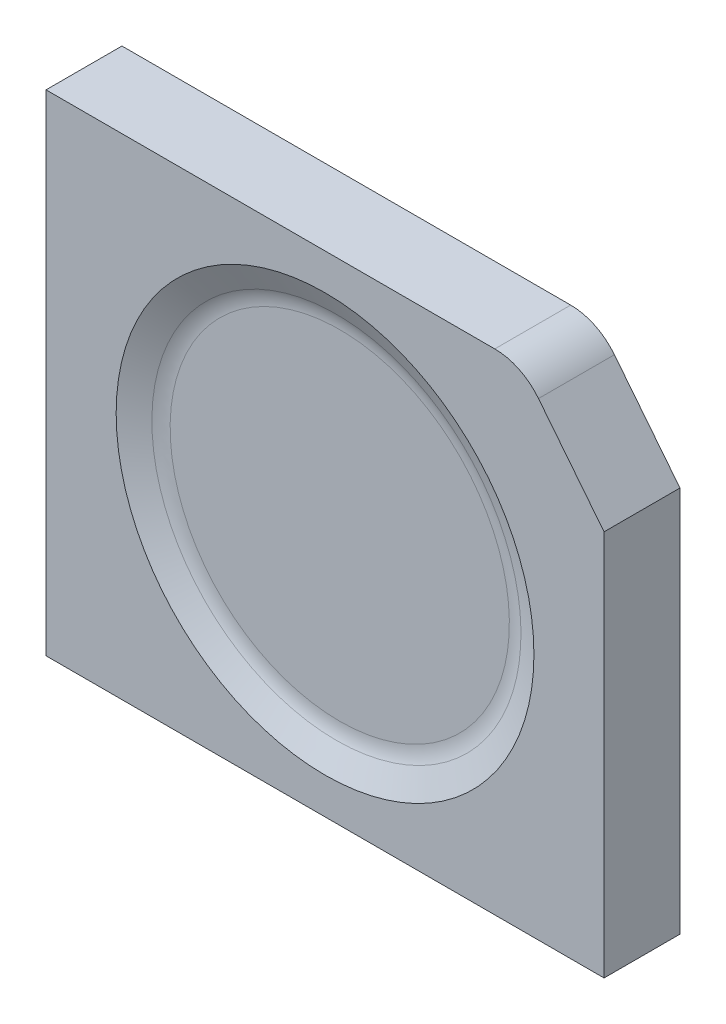
ISO-10303-21;
HEADER;
FILE_DESCRIPTION(('STEP AP214'),'2;1');
FILE_NAME('part.step','',(''),(''),'','','');
FILE_SCHEMA(('AUTOMOTIVE_DESIGN { 1 0 10303 214 1 1 1 1 }'));
ENDSEC;
DATA;
#1=APPLICATION_CONTEXT('core data for automotive mechanical design processes');
#2=APPLICATION_PROTOCOL_DEFINITION('international standard','automotive_design',2000,#1);
#3=PRODUCT_CONTEXT('',#1,'mechanical');
#4=PRODUCT('Part','Part','',(#3));
#5=PRODUCT_RELATED_PRODUCT_CATEGORY('part','',(#4));
#6=PRODUCT_DEFINITION_FORMATION('','',#4);
#7=PRODUCT_DEFINITION_CONTEXT('part definition',#1,'design');
#8=PRODUCT_DEFINITION('design','',#6,#7);
#9=PRODUCT_DEFINITION_SHAPE('','',#8);
#10=(LENGTH_UNIT() NAMED_UNIT(*) SI_UNIT(.MILLI.,.METRE.));
#11=(NAMED_UNIT(*) PLANE_ANGLE_UNIT() SI_UNIT($,.RADIAN.));
#12=(NAMED_UNIT(*) SI_UNIT($,.STERADIAN.) SOLID_ANGLE_UNIT());
#13=UNCERTAINTY_MEASURE_WITH_UNIT(LENGTH_MEASURE(1.E-05),#10,'distance_accuracy_value','');
#14=(GEOMETRIC_REPRESENTATION_CONTEXT(3) GLOBAL_UNCERTAINTY_ASSIGNED_CONTEXT((#13)) GLOBAL_UNIT_ASSIGNED_CONTEXT((#10,
#11,#12)) REPRESENTATION_CONTEXT('',''));
#15=CARTESIAN_POINT('',(0.,0.,0.));
#16=DIRECTION('',(0.,0.,1.));
#17=DIRECTION('',(1.,0.,0.));
#18=AXIS2_PLACEMENT_3D('',#15,#16,#17);
#19=CARTESIAN_POINT('',(0.,0.,150.542283063692));
#20=DIRECTION('',(0.,0.,-1.));
#21=DIRECTION('',(-1.,0.,0.));
#22=AXIS2_PLACEMENT_3D('',#19,#20,#21);
#23=PLANE('',#22);
#24=CARTESIAN_POINT('',(149.999999999993,131.7625,150.542283063692));
#25=DIRECTION('',(0.,0.,-1.));
#26=DIRECTION('',(-1.,0.,0.));
#27=AXIS2_PLACEMENT_3D('',#24,#25,#26);
#28=CIRCLE('',#27,112.298492350913);
#29=CARTESIAN_POINT('',(37.7015076490804,131.7625,150.542283063692));
#30=VERTEX_POINT('',#29);
#31=EDGE_CURVE('E108',#30,#30,#28,.F.);
#32=ORIENTED_EDGE('',*,*,#31,.T.);
#33=EDGE_LOOP('',(#32));
#34=FACE_BOUND('',#33,.T.);
#35=CARTESIAN_POINT('',(241.253264434507,233.525,150.542283063692));
#36=DIRECTION('',(0.,0.,-1.));
#37=DIRECTION('',(-1.,0.,0.));
#38=AXIS2_PLACEMENT_3D('',#35,#36,#37);
#39=CIRCLE('',#38,30.);
#40=CARTESIAN_POINT('',(241.253264434507,263.525,150.542283063692));
#41=VERTEX_POINT('',#40);
#42=CARTESIAN_POINT('',(264.758194807193,252.166841330061,150.542283063692));
#43=VERTEX_POINT('',#42);
#44=EDGE_CURVE('E115',#41,#43,#39,.T.);
#45=ORIENTED_EDGE('',*,*,#44,.T.);
#46=DIRECTION('',(0.621394711002044,-0.783497679089534,0.));
#47=VECTOR('',#46,1.);
#48=CARTESIAN_POINT('',(264.758194807193,252.166841330061,150.542283063692));
#49=LINE('',#48,#47);
#50=CARTESIAN_POINT('',(300.,207.73152173913,150.542283063692));
#51=VERTEX_POINT('',#50);
#52=EDGE_CURVE('E113',#43,#51,#49,.T.);
#53=ORIENTED_EDGE('',*,*,#52,.T.);
#54=DIRECTION('',(0.,-1.,0.));
#55=VECTOR('',#54,1.);
#56=CARTESIAN_POINT('',(300.,0.,150.542283063692));
#57=LINE('',#56,#55);
#58=CARTESIAN_POINT('',(300.,0.,150.542283063692));
#59=VERTEX_POINT('',#58);
#60=EDGE_CURVE('E107',#51,#59,#57,.T.);
#61=ORIENTED_EDGE('',*,*,#60,.T.);
#62=DIRECTION('',(-1.,0.,0.));
#63=VECTOR('',#62,1.);
#64=CARTESIAN_POINT('',(0.,0.,150.542283063692));
#65=LINE('',#64,#63);
#66=CARTESIAN_POINT('',(0.,0.,150.542283063692));
#67=VERTEX_POINT('',#66);
#68=EDGE_CURVE('E92',#59,#67,#65,.T.);
#69=ORIENTED_EDGE('',*,*,#68,.T.);
#70=DIRECTION('',(0.,1.,0.));
#71=VECTOR('',#70,1.);
#72=CARTESIAN_POINT('',(0.,263.525,150.542283063692));
#73=LINE('',#72,#71);
#74=CARTESIAN_POINT('',(0.,263.525,150.542283063692));
#75=VERTEX_POINT('',#74);
#76=EDGE_CURVE('E104',#67,#75,#73,.T.);
#77=ORIENTED_EDGE('',*,*,#76,.T.);
#78=DIRECTION('',(-1.,0.,0.));
#79=VECTOR('',#78,1.);
#80=CARTESIAN_POINT('',(0.,263.525,150.542283063692));
#81=LINE('',#80,#79);
#82=EDGE_CURVE('E137',#41,#75,#81,.T.);
#83=ORIENTED_EDGE('',*,*,#82,.F.);
#84=EDGE_LOOP('',(#45,#53,#61,#69,#77,#83));
#85=FACE_BOUND('',#84,.T.);
#86=ADVANCED_FACE('F34',(#34,#85),#23,.T.);
#87=CARTESIAN_POINT('',(149.999999999992,131.762500000001,183.447474194888));
#88=DIRECTION('',(0.,0.,-1.));
#89=DIRECTION('',(0.,1.,0.));
#90=AXIS2_PLACEMENT_3D('',#87,#88,#89);
#91=PLANE('',#90);
#92=CARTESIAN_POINT('',(149.999999999992,131.7625,183.447474194888));
#93=DIRECTION('',(0.,0.,1.));
#94=DIRECTION('',(0.,-1.,0.));
#95=AXIS2_PLACEMENT_3D('',#92,#93,#94);
#96=CIRCLE('',#95,91.1860000000005);
#97=CARTESIAN_POINT('',(149.999999999992,40.5764999999999,183.447474194888));
#98=VERTEX_POINT('',#97);
#99=EDGE_CURVE('E122',#98,#98,#96,.T.);
#100=ORIENTED_EDGE('',*,*,#99,.T.);
#101=EDGE_LOOP('',(#100));
#102=FACE_BOUND('',#101,.T.);
#103=ADVANCED_FACE('F158',(#102),#91,.F.);
#104=CARTESIAN_POINT('',(149.999999999992,40.5765,183.447474194888));
#105=CARTESIAN_POINT('',(149.999999999992,37.7694243510798,183.447474194887));
#106=CARTESIAN_POINT('',(149.999999999992,35.0528419151209,184.061599328128));
#107=CARTESIAN_POINT('',(149.999999999992,32.5497747474938,185.23231085184));
#108=(BOUNDED_CURVE() B_SPLINE_CURVE(3,(#104,#105,#106,#107),.UNSPECIFIED.,.F.,
.F.) B_SPLINE_CURVE_WITH_KNOTS((4,4),(0.,1.),
.UNSPECIFIED.) CURVE() GEOMETRIC_REPRESENTATION_ITEM() RATIONAL_B_SPLINE_CURVE((0.254333095030252,
0.254333095030252,0.258499793724843,0.266833191114025)) REPRESENTATION_ITEM(''));
#109=CARTESIAN_POINT('',(149.999999999992,131.7625,225.400182821008));
#110=DIRECTION('',(0.,0.,1.));
#111=AXIS1_PLACEMENT('',#109,#110);
#112=SURFACE_OF_REVOLUTION('',#108,#111);
#113=CARTESIAN_POINT('',(149.999999999992,131.7625,185.23231085184));
#114=DIRECTION('',(0.,0.,1.));
#115=DIRECTION('',(0.,-1.,0.));
#116=AXIS2_PLACEMENT_3D('',#113,#114,#115);
#117=CIRCLE('',#116,99.2127252525066);
#118=CARTESIAN_POINT('',(149.999999999992,32.5497747474938,185.23231085184));
#119=VERTEX_POINT('',#118);
#120=EDGE_CURVE('E147',#119,#119,#117,.T.);
#121=ORIENTED_EDGE('',*,*,#120,.T.);
#122=EDGE_LOOP('',(#121));
#123=FACE_BOUND('',#122,.T.);
#124=ORIENTED_EDGE('',*,*,#99,.F.);
#125=EDGE_LOOP('',(#124));
#126=FACE_BOUND('',#125,.T.);
#127=ADVANCED_FACE('F153',(#123,#126),#112,.F.);
#128=CARTESIAN_POINT('',(149.999999999992,131.7625,185.23231085184));
#129=DIRECTION('',(0.,0.,1.));
#130=DIRECTION('',(0.,-1.,0.));
#131=AXIS2_PLACEMENT_3D('',#128,#129,#130);
#132=CONICAL_SURFACE('',#131,99.2127252525066,1.13331210913786);
#133=CARTESIAN_POINT('',(149.999999999992,131.7625,191.352665326085));
#134=DIRECTION('',(0.,0.,1.));
#135=DIRECTION('',(0.,-1.,0.));
#136=AXIS2_PLACEMENT_3D('',#133,#134,#135);
#137=CIRCLE('',#136,112.298492350919);
#138=CARTESIAN_POINT('',(149.999999999992,19.4640076490818,191.352665326084));
#139=VERTEX_POINT('',#138);
#140=EDGE_CURVE('E206',#139,#139,#137,.T.);
#141=ORIENTED_EDGE('',*,*,#140,.T.);
#142=EDGE_LOOP('',(#141));
#143=FACE_BOUND('',#142,.T.);
#144=ORIENTED_EDGE('',*,*,#120,.F.);
#145=EDGE_LOOP('',(#144));
#146=FACE_BOUND('',#145,.T.);
#147=ADVANCED_FACE('F157',(#143,#146),#132,.F.);
#148=CARTESIAN_POINT('',(300.,0.,286.76549888));
#149=DIRECTION('',(-1.,0.,0.));
#150=DIRECTION('',(0.,-1.,0.));
#151=AXIS2_PLACEMENT_3D('',#148,#149,#150);
#152=PLANE('',#151);
#153=ORIENTED_EDGE('',*,*,#60,.F.);
#154=DIRECTION('',(0.,0.,-1.));
#155=VECTOR('',#154,1.);
#156=CARTESIAN_POINT('',(300.,207.73152173913,286.76549888));
#157=LINE('',#156,#155);
#158=CARTESIAN_POINT('',(300.,207.73152173913,191.352665326085));
#159=VERTEX_POINT('',#158);
#160=EDGE_CURVE('E121',#159,#51,#157,.T.);
#161=ORIENTED_EDGE('',*,*,#160,.F.);
#162=DIRECTION('',(0.,-1.,0.));
#163=VECTOR('',#162,1.);
#164=CARTESIAN_POINT('',(300.,3.30149878716484E-13,191.352665326084));
#165=LINE('',#164,#163);
#166=CARTESIAN_POINT('',(300.,0.,191.352665326084));
#167=VERTEX_POINT('',#166);
#168=EDGE_CURVE('E127',#159,#167,#165,.T.);
#169=ORIENTED_EDGE('',*,*,#168,.T.);
#170=DIRECTION('',(0.,0.,-1.));
#171=VECTOR('',#170,1.);
#172=CARTESIAN_POINT('',(300.,0.,286.76549888));
#173=LINE('',#172,#171);
#174=EDGE_CURVE('E98',#167,#59,#173,.T.);
#175=ORIENTED_EDGE('',*,*,#174,.T.);
#176=EDGE_LOOP('',(#153,#161,#169,#175));
#177=FACE_BOUND('',#176,.T.);
#178=ADVANCED_FACE('F125',(#177),#152,.F.);
#179=CARTESIAN_POINT('',(0.,263.525,0.));
#180=DIRECTION('',(0.,1.,0.));
#181=DIRECTION('',(0.,0.,1.));
#182=AXIS2_PLACEMENT_3D('',#179,#180,#181);
#183=PLANE('',#182);
#184=DIRECTION('',(0.,0.,-1.));
#185=VECTOR('',#184,1.);
#186=CARTESIAN_POINT('',(241.253264434507,263.525,286.76549888));
#187=LINE('',#186,#185);
#188=CARTESIAN_POINT('',(241.253264434507,263.525,191.352665326085));
#189=VERTEX_POINT('',#188);
#190=EDGE_CURVE('E11',#189,#41,#187,.T.);
#191=ORIENTED_EDGE('',*,*,#190,.T.);
#192=ORIENTED_EDGE('',*,*,#82,.T.);
#193=DIRECTION('',(0.,0.,-1.));
#194=VECTOR('',#193,1.);
#195=CARTESIAN_POINT('',(0.,263.525,286.76549888));
#196=LINE('',#195,#194);
#197=CARTESIAN_POINT('',(0.,263.525,191.352665326085));
#198=VERTEX_POINT('',#197);
#199=EDGE_CURVE('E42',#198,#75,#196,.T.);
#200=ORIENTED_EDGE('',*,*,#199,.F.);
#201=DIRECTION('',(-1.,0.,0.));
#202=VECTOR('',#201,1.);
#203=CARTESIAN_POINT('',(0.,263.525,191.352665326085));
#204=LINE('',#203,#202);
#205=EDGE_CURVE('E134',#189,#198,#204,.T.);
#206=ORIENTED_EDGE('',*,*,#205,.F.);
#207=EDGE_LOOP('',(#191,#192,#200,#206));
#208=FACE_BOUND('',#207,.T.);
#209=ADVANCED_FACE('F217',(#208),#183,.T.);
#210=CARTESIAN_POINT('',(0.,-6.62123289879906E-13,191.352665326084));
#211=DIRECTION('',(0.,0.,-1.));
#212=DIRECTION('',(0.,1.,0.));
#213=AXIS2_PLACEMENT_3D('',#210,#211,#212);
#214=PLANE('',#213);
#215=DIRECTION('',(-1.,0.,0.));
#216=VECTOR('',#215,1.);
#217=CARTESIAN_POINT('',(0.,0.,191.352665326084));
#218=LINE('',#217,#216);
#219=CARTESIAN_POINT('',(0.,0.,191.352665326085));
#220=VERTEX_POINT('',#219);
#221=EDGE_CURVE('E95',#167,#220,#218,.T.);
#222=ORIENTED_EDGE('',*,*,#221,.F.);
#223=ORIENTED_EDGE('',*,*,#168,.F.);
#224=DIRECTION('',(0.621394711002044,-0.783497679089534,0.));
#225=VECTOR('',#224,1.);
#226=CARTESIAN_POINT('',(264.758194807193,252.166841330062,191.352665326085));
#227=LINE('',#226,#225);
#228=CARTESIAN_POINT('',(264.758194807193,252.166841330061,191.352665326085));
#229=VERTEX_POINT('',#228);
#230=EDGE_CURVE('E56',#229,#159,#227,.T.);
#231=ORIENTED_EDGE('',*,*,#230,.F.);
#232=CARTESIAN_POINT('',(241.253264434507,233.525,191.352665326085));
#233=DIRECTION('',(0.,0.,-1.));
#234=DIRECTION('',(0.,1.,0.));
#235=AXIS2_PLACEMENT_3D('',#232,#233,#234);
#236=CIRCLE('',#235,30.);
#237=EDGE_CURVE('E49',#189,#229,#236,.T.);
#238=ORIENTED_EDGE('',*,*,#237,.F.);
#239=ORIENTED_EDGE('',*,*,#205,.T.);
#240=DIRECTION('',(0.,1.,0.));
#241=VECTOR('',#240,1.);
#242=CARTESIAN_POINT('',(0.,263.525,191.352665326085));
#243=LINE('',#242,#241);
#244=EDGE_CURVE('E129',#220,#198,#243,.T.);
#245=ORIENTED_EDGE('',*,*,#244,.F.);
#246=EDGE_LOOP('',(#222,#223,#231,#238,#239,#245));
#247=FACE_BOUND('',#246,.T.);
#248=ORIENTED_EDGE('',*,*,#140,.F.);
#249=EDGE_LOOP('',(#248));
#250=FACE_BOUND('',#249,.T.);
#251=ADVANCED_FACE('F131',(#247,#250),#214,.F.);
#252=CARTESIAN_POINT('',(0.,0.,286.76549888));
#253=DIRECTION('',(0.,1.,0.));
#254=DIRECTION('',(0.,0.,1.));
#255=AXIS2_PLACEMENT_3D('',#252,#253,#254);
#256=PLANE('',#255);
#257=ORIENTED_EDGE('',*,*,#68,.F.);
#258=ORIENTED_EDGE('',*,*,#174,.F.);
#259=ORIENTED_EDGE('',*,*,#221,.T.);
#260=DIRECTION('',(0.,0.,-1.));
#261=VECTOR('',#260,1.);
#262=CARTESIAN_POINT('',(0.,0.,286.76549888));
#263=LINE('',#262,#261);
#264=EDGE_CURVE('E88',#220,#67,#263,.T.);
#265=ORIENTED_EDGE('',*,*,#264,.T.);
#266=EDGE_LOOP('',(#257,#258,#259,#265));
#267=FACE_BOUND('',#266,.T.);
#268=ADVANCED_FACE('F90',(#267),#256,.F.);
#269=CARTESIAN_POINT('',(0.,263.525,286.76549888));
#270=DIRECTION('',(1.,0.,0.));
#271=DIRECTION('',(0.,0.,-1.));
#272=AXIS2_PLACEMENT_3D('',#269,#270,#271);
#273=PLANE('',#272);
#274=ORIENTED_EDGE('',*,*,#76,.F.);
#275=ORIENTED_EDGE('',*,*,#264,.F.);
#276=ORIENTED_EDGE('',*,*,#244,.T.);
#277=ORIENTED_EDGE('',*,*,#199,.T.);
#278=EDGE_LOOP('',(#274,#275,#276,#277));
#279=FACE_BOUND('',#278,.T.);
#280=ADVANCED_FACE('F110',(#279),#273,.F.);
#281=CARTESIAN_POINT('',(241.253264434507,233.525,286.76549888));
#282=DIRECTION('',(0.,0.,-1.));
#283=DIRECTION('',(-1.,0.,0.));
#284=AXIS2_PLACEMENT_3D('',#281,#282,#283);
#285=CYLINDRICAL_SURFACE('',#284,30.);
#286=ORIENTED_EDGE('',*,*,#44,.F.);
#287=ORIENTED_EDGE('',*,*,#190,.F.);
#288=ORIENTED_EDGE('',*,*,#237,.T.);
#289=DIRECTION('',(0.,0.,-1.));
#290=VECTOR('',#289,1.);
#291=CARTESIAN_POINT('',(264.758194807193,252.166841330061,286.76549888));
#292=LINE('',#291,#290);
#293=EDGE_CURVE('E119',#229,#43,#292,.T.);
#294=ORIENTED_EDGE('',*,*,#293,.T.);
#295=EDGE_LOOP('',(#286,#287,#288,#294));
#296=FACE_BOUND('',#295,.T.);
#297=ADVANCED_FACE('F187',(#296),#285,.T.);
#298=CARTESIAN_POINT('',(264.758194807193,252.166841330061,286.76549888));
#299=DIRECTION('',(-0.783497679089534,-0.621394711002044,0.));
#300=DIRECTION('',(0.621394711002044,-0.783497679089534,0.));
#301=AXIS2_PLACEMENT_3D('',#298,#299,#300);
#302=PLANE('',#301);
#303=ORIENTED_EDGE('',*,*,#52,.F.);
#304=ORIENTED_EDGE('',*,*,#293,.F.);
#305=ORIENTED_EDGE('',*,*,#230,.T.);
#306=ORIENTED_EDGE('',*,*,#160,.T.);
#307=EDGE_LOOP('',(#303,#304,#305,#306));
#308=FACE_BOUND('',#307,.T.);
#309=ADVANCED_FACE('F186',(#308),#302,.F.);
#310=CARTESIAN_POINT('',(149.999999999998,131.7625,156.662637537934));
#311=DIRECTION('',(0.,0.,-1.));
#312=DIRECTION('',(-1.,0.,0.));
#313=AXIS2_PLACEMENT_3D('',#310,#311,#312);
#314=CONICAL_SURFACE('',#313,99.2127252525065,1.13331210913781);
#315=CARTESIAN_POINT('',(149.999999999998,131.7625,156.662637537934));
#316=DIRECTION('',(0.,0.,1.));
#317=DIRECTION('',(1.,0.,0.));
#318=AXIS2_PLACEMENT_3D('',#315,#316,#317);
#319=CIRCLE('',#318,99.2127252525065);
#320=CARTESIAN_POINT('',(249.212725252504,131.7625,156.662637537932));
#321=VERTEX_POINT('',#320);
#322=EDGE_CURVE('E142',#321,#321,#319,.T.);
#323=ORIENTED_EDGE('',*,*,#322,.T.);
#324=EDGE_LOOP('',(#323));
#325=FACE_BOUND('',#324,.T.);
#326=ORIENTED_EDGE('',*,*,#31,.F.);
#327=EDGE_LOOP('',(#326));
#328=FACE_BOUND('',#327,.T.);
#329=ADVANCED_FACE('F36',(#325,#328),#314,.F.);
#330=CARTESIAN_POINT('',(149.999999999998,131.7625,158.447474194887));
#331=DIRECTION('',(0.,0.,-1.));
#332=DIRECTION('',(-1.,0.,0.));
#333=AXIS2_PLACEMENT_3D('',#330,#331,#332);
#334=PLANE('',#333);
#335=CARTESIAN_POINT('',(149.999999999998,131.7625,158.447474194887));
#336=DIRECTION('',(0.,0.,1.));
#337=DIRECTION('',(1.,0.,0.));
#338=AXIS2_PLACEMENT_3D('',#335,#336,#337);
#339=CIRCLE('',#338,91.1860000000005);
#340=CARTESIAN_POINT('',(241.185999999998,131.7625,158.447474194885));
#341=VERTEX_POINT('',#340);
#342=EDGE_CURVE('E178',#341,#341,#339,.T.);
#343=ORIENTED_EDGE('',*,*,#342,.F.);
#344=EDGE_LOOP('',(#343));
#345=FACE_BOUND('',#344,.T.);
#346=ADVANCED_FACE('F165',(#345),#334,.T.);
#347=CARTESIAN_POINT('',(241.185999999998,131.7625,158.447474194885));
#348=CARTESIAN_POINT('',(243.993075648918,131.7625,158.447474194885));
#349=CARTESIAN_POINT('',(246.709658084877,131.7625,157.833349061644));
#350=CARTESIAN_POINT('',(249.212725252504,131.7625,156.662637537932));
#351=(BOUNDED_CURVE() B_SPLINE_CURVE(3,(#347,#348,#349,#350),.UNSPECIFIED.,.F.,
.F.) B_SPLINE_CURVE_WITH_KNOTS((4,4),(0.,1.),
.UNSPECIFIED.) CURVE() GEOMETRIC_REPRESENTATION_ITEM() RATIONAL_B_SPLINE_CURVE((0.254333095030252,
0.254333095030252,0.258499793724843,0.266833191114025)) REPRESENTATION_ITEM(''));
#352=CARTESIAN_POINT('',(149.999999999999,131.7625,200.400182821007));
#353=DIRECTION('',(0.,0.,1.));
#354=AXIS1_PLACEMENT('',#352,#353);
#355=SURFACE_OF_REVOLUTION('',#351,#354);
#356=ORIENTED_EDGE('',*,*,#322,.F.);
#357=EDGE_LOOP('',(#356));
#358=FACE_BOUND('',#357,.T.);
#359=ORIENTED_EDGE('',*,*,#342,.T.);
#360=EDGE_LOOP('',(#359));
#361=FACE_BOUND('',#360,.T.);
#362=ADVANCED_FACE('F161',(#358,#361),#355,.T.);
#363=CLOSED_SHELL('',(#86,#103,#127,#147,#178,#209,#251,#268,#280,#297,#309,#329,#346,#362));
#364=MANIFOLD_SOLID_BREP('B2',#363);
#365=ADVANCED_BREP_SHAPE_REPRESENTATION('',(#18,#364),#14);
#366=SHAPE_DEFINITION_REPRESENTATION(#9,#365);
ENDSEC;
END-ISO-10303-21;
